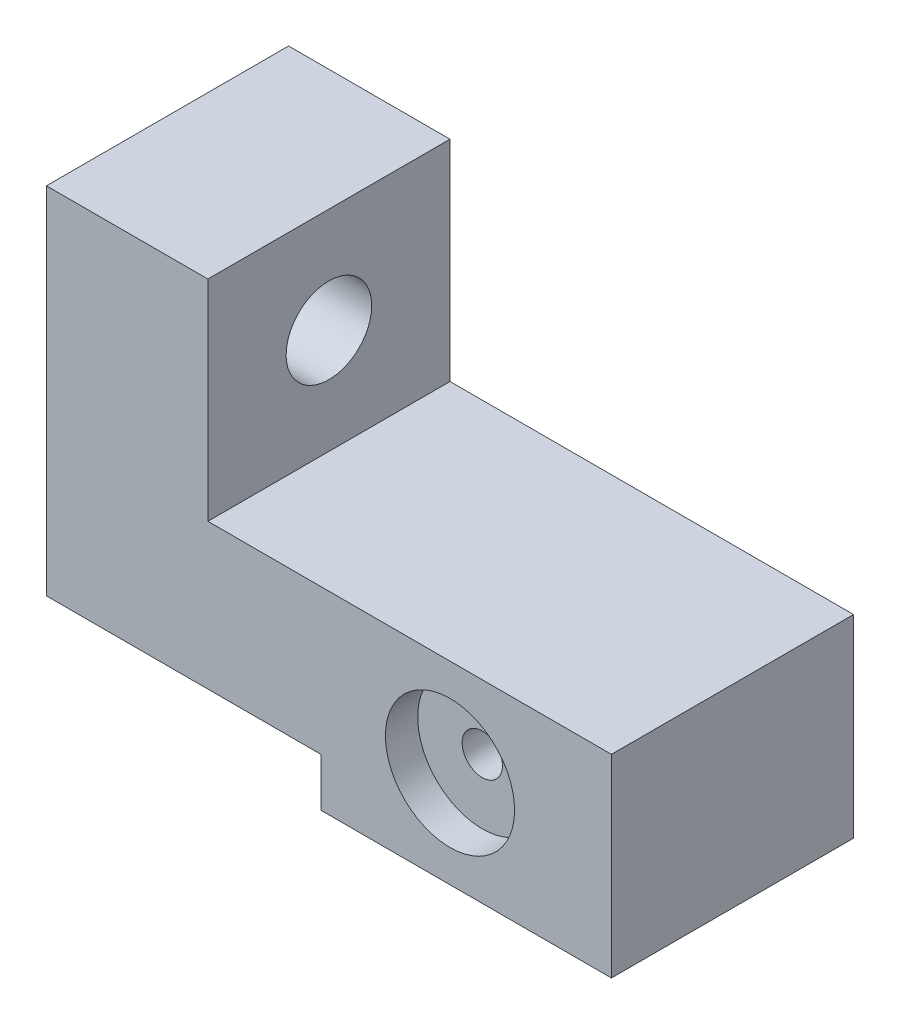
ISO-10303-21;
HEADER;
FILE_DESCRIPTION(('STEP AP214'),'2;1');
FILE_NAME('part.step','',(''),(''),'','','');
FILE_SCHEMA(('AUTOMOTIVE_DESIGN { 1 0 10303 214 1 1 1 1 }'));
ENDSEC;
DATA;
#1=APPLICATION_CONTEXT('core data for automotive mechanical design processes');
#2=APPLICATION_PROTOCOL_DEFINITION('international standard','automotive_design',2000,#1);
#3=PRODUCT_CONTEXT('',#1,'mechanical');
#4=PRODUCT('Part','Part','',(#3));
#5=PRODUCT_RELATED_PRODUCT_CATEGORY('part','',(#4));
#6=PRODUCT_DEFINITION_FORMATION('','',#4);
#7=PRODUCT_DEFINITION_CONTEXT('part definition',#1,'design');
#8=PRODUCT_DEFINITION('design','',#6,#7);
#9=PRODUCT_DEFINITION_SHAPE('','',#8);
#10=(LENGTH_UNIT() NAMED_UNIT(*) SI_UNIT(.MILLI.,.METRE.));
#11=(NAMED_UNIT(*) PLANE_ANGLE_UNIT() SI_UNIT($,.RADIAN.));
#12=(NAMED_UNIT(*) SI_UNIT($,.STERADIAN.) SOLID_ANGLE_UNIT());
#13=UNCERTAINTY_MEASURE_WITH_UNIT(LENGTH_MEASURE(1.E-05),#10,'distance_accuracy_value','');
#14=(GEOMETRIC_REPRESENTATION_CONTEXT(3) GLOBAL_UNCERTAINTY_ASSIGNED_CONTEXT((#13)) GLOBAL_UNIT_ASSIGNED_CONTEXT((#10,
#11,#12)) REPRESENTATION_CONTEXT('',''));
#15=CARTESIAN_POINT('',(0.,0.,0.));
#16=DIRECTION('',(0.,0.,1.));
#17=DIRECTION('',(1.,0.,0.));
#18=AXIS2_PLACEMENT_3D('',#15,#16,#17);
#19=CARTESIAN_POINT('',(25.,6.,15.));
#20=DIRECTION('',(0.,0.,1.));
#21=DIRECTION('',(1.,0.,0.));
#22=AXIS2_PLACEMENT_3D('',#19,#20,#21);
#23=CYLINDRICAL_SURFACE('',#22,1.24999999999999);
#24=CARTESIAN_POINT('',(25.,6.,0.));
#25=DIRECTION('',(0.,0.,1.));
#26=DIRECTION('',(1.,0.,0.));
#27=AXIS2_PLACEMENT_3D('',#24,#25,#26);
#28=CIRCLE('',#27,1.25);
#29=CARTESIAN_POINT('',(26.25,6.,0.));
#30=VERTEX_POINT('',#29);
#31=EDGE_CURVE('E181',#30,#30,#28,.T.);
#32=ORIENTED_EDGE('',*,*,#31,.F.);
#33=EDGE_LOOP('',(#32));
#34=FACE_BOUND('',#33,.T.);
#35=CARTESIAN_POINT('',(25.,6.,13.));
#36=DIRECTION('',(0.,0.,1.));
#37=DIRECTION('',(1.,0.,0.));
#38=AXIS2_PLACEMENT_3D('',#35,#36,#37);
#39=CIRCLE('',#38,1.24999999999999);
#40=CARTESIAN_POINT('',(26.25,6.,13.));
#41=VERTEX_POINT('',#40);
#42=EDGE_CURVE('E55',#41,#41,#39,.F.);
#43=ORIENTED_EDGE('',*,*,#42,.F.);
#44=EDGE_LOOP('',(#43));
#45=FACE_BOUND('',#44,.T.);
#46=ADVANCED_FACE('F51',(#34,#45),#23,.F.);
#47=CARTESIAN_POINT('',(35.,0.,15.));
#48=DIRECTION('',(-1.,0.,0.));
#49=DIRECTION('',(0.,0.,1.));
#50=AXIS2_PLACEMENT_3D('',#47,#48,#49);
#51=PLANE('',#50);
#52=DIRECTION('',(0.,1.,0.));
#53=VECTOR('',#52,1.);
#54=CARTESIAN_POINT('',(35.,0.,0.));
#55=LINE('',#54,#53);
#56=CARTESIAN_POINT('',(35.,0.,0.));
#57=VERTEX_POINT('',#56);
#58=CARTESIAN_POINT('',(35.,12.,0.));
#59=VERTEX_POINT('',#58);
#60=EDGE_CURVE('E150',#57,#59,#55,.T.);
#61=ORIENTED_EDGE('',*,*,#60,.T.);
#62=DIRECTION('',(0.,0.,-1.));
#63=VECTOR('',#62,1.);
#64=CARTESIAN_POINT('',(35.,12.,15.));
#65=LINE('',#64,#63);
#66=CARTESIAN_POINT('',(35.,12.,15.));
#67=VERTEX_POINT('',#66);
#68=EDGE_CURVE('E13',#67,#59,#65,.T.);
#69=ORIENTED_EDGE('',*,*,#68,.F.);
#70=DIRECTION('',(0.,1.,0.));
#71=VECTOR('',#70,1.);
#72=CARTESIAN_POINT('',(35.,0.,15.));
#73=LINE('',#72,#71);
#74=CARTESIAN_POINT('',(35.,0.,15.));
#75=VERTEX_POINT('',#74);
#76=EDGE_CURVE('E165',#75,#67,#73,.T.);
#77=ORIENTED_EDGE('',*,*,#76,.F.);
#78=DIRECTION('',(0.,0.,-1.));
#79=VECTOR('',#78,1.);
#80=CARTESIAN_POINT('',(35.,0.,15.));
#81=LINE('',#80,#79);
#82=EDGE_CURVE('E146',#75,#57,#81,.T.);
#83=ORIENTED_EDGE('',*,*,#82,.T.);
#84=EDGE_LOOP('',(#61,#69,#77,#83));
#85=FACE_BOUND('',#84,.T.);
#86=ADVANCED_FACE('F53',(#85),#51,.F.);
#87=CARTESIAN_POINT('',(35.,12.,15.));
#88=DIRECTION('',(0.,-1.,0.));
#89=DIRECTION('',(1.,0.,0.));
#90=AXIS2_PLACEMENT_3D('',#87,#88,#89);
#91=PLANE('',#90);
#92=DIRECTION('',(-1.,0.,0.));
#93=VECTOR('',#92,1.);
#94=CARTESIAN_POINT('',(35.,12.,0.));
#95=LINE('',#94,#93);
#96=CARTESIAN_POINT('',(10.,12.,0.));
#97=VERTEX_POINT('',#96);
#98=EDGE_CURVE('E153',#59,#97,#95,.T.);
#99=ORIENTED_EDGE('',*,*,#98,.T.);
#100=DIRECTION('',(0.,0.,-1.));
#101=VECTOR('',#100,1.);
#102=CARTESIAN_POINT('',(10.,12.,15.));
#103=LINE('',#102,#101);
#104=CARTESIAN_POINT('',(10.,12.,15.));
#105=VERTEX_POINT('',#104);
#106=EDGE_CURVE('E61',#105,#97,#103,.T.);
#107=ORIENTED_EDGE('',*,*,#106,.F.);
#108=DIRECTION('',(-1.,0.,0.));
#109=VECTOR('',#108,1.);
#110=CARTESIAN_POINT('',(35.,12.,15.));
#111=LINE('',#110,#109);
#112=EDGE_CURVE('E113',#67,#105,#111,.T.);
#113=ORIENTED_EDGE('',*,*,#112,.F.);
#114=ORIENTED_EDGE('',*,*,#68,.T.);
#115=EDGE_LOOP('',(#99,#107,#113,#114));
#116=FACE_BOUND('',#115,.T.);
#117=ADVANCED_FACE('F228',(#116),#91,.F.);
#118=CARTESIAN_POINT('',(10.,12.,15.));
#119=DIRECTION('',(-1.,0.,0.));
#120=DIRECTION('',(0.,-1.,0.));
#121=AXIS2_PLACEMENT_3D('',#118,#119,#120);
#122=PLANE('',#121);
#123=CARTESIAN_POINT('',(10.,18.5,7.5));
#124=DIRECTION('',(1.,0.,0.));
#125=DIRECTION('',(0.,1.,0.));
#126=AXIS2_PLACEMENT_3D('',#123,#124,#125);
#127=CIRCLE('',#126,2.65);
#128=CARTESIAN_POINT('',(10.,21.15,7.5));
#129=VERTEX_POINT('',#128);
#130=EDGE_CURVE('E177',#129,#129,#127,.T.);
#131=ORIENTED_EDGE('',*,*,#130,.F.);
#132=EDGE_LOOP('',(#131));
#133=FACE_BOUND('',#132,.T.);
#134=DIRECTION('',(0.,1.,0.));
#135=VECTOR('',#134,1.);
#136=CARTESIAN_POINT('',(10.,12.,0.));
#137=LINE('',#136,#135);
#138=CARTESIAN_POINT('',(10.,25.,0.));
#139=VERTEX_POINT('',#138);
#140=EDGE_CURVE('E156',#97,#139,#137,.T.);
#141=ORIENTED_EDGE('',*,*,#140,.T.);
#142=DIRECTION('',(0.,0.,-1.));
#143=VECTOR('',#142,1.);
#144=CARTESIAN_POINT('',(10.,25.,15.));
#145=LINE('',#144,#143);
#146=CARTESIAN_POINT('',(10.,25.,15.));
#147=VERTEX_POINT('',#146);
#148=EDGE_CURVE('E172',#147,#139,#145,.T.);
#149=ORIENTED_EDGE('',*,*,#148,.F.);
#150=DIRECTION('',(0.,1.,0.));
#151=VECTOR('',#150,1.);
#152=CARTESIAN_POINT('',(10.,12.,15.));
#153=LINE('',#152,#151);
#154=EDGE_CURVE('E191',#105,#147,#153,.T.);
#155=ORIENTED_EDGE('',*,*,#154,.F.);
#156=ORIENTED_EDGE('',*,*,#106,.T.);
#157=EDGE_LOOP('',(#141,#149,#155,#156));
#158=FACE_BOUND('',#157,.T.);
#159=ADVANCED_FACE('F309',(#133,#158),#122,.F.);
#160=CARTESIAN_POINT('',(10.,25.,15.));
#161=DIRECTION('',(0.,-1.,0.));
#162=DIRECTION('',(0.,0.,-1.));
#163=AXIS2_PLACEMENT_3D('',#160,#161,#162);
#164=PLANE('',#163);
#165=DIRECTION('',(-1.,0.,0.));
#166=VECTOR('',#165,1.);
#167=CARTESIAN_POINT('',(10.,25.,0.));
#168=LINE('',#167,#166);
#169=CARTESIAN_POINT('',(0.,25.,0.));
#170=VERTEX_POINT('',#169);
#171=EDGE_CURVE('E158',#139,#170,#168,.T.);
#172=ORIENTED_EDGE('',*,*,#171,.T.);
#173=DIRECTION('',(0.,0.,-1.));
#174=VECTOR('',#173,1.);
#175=CARTESIAN_POINT('',(0.,25.,15.));
#176=LINE('',#175,#174);
#177=CARTESIAN_POINT('',(0.,25.,15.));
#178=VERTEX_POINT('',#177);
#179=EDGE_CURVE('E169',#178,#170,#176,.T.);
#180=ORIENTED_EDGE('',*,*,#179,.F.);
#181=DIRECTION('',(-1.,0.,0.));
#182=VECTOR('',#181,1.);
#183=CARTESIAN_POINT('',(10.,25.,15.));
#184=LINE('',#183,#182);
#185=EDGE_CURVE('E193',#147,#178,#184,.T.);
#186=ORIENTED_EDGE('',*,*,#185,.F.);
#187=ORIENTED_EDGE('',*,*,#148,.T.);
#188=EDGE_LOOP('',(#172,#180,#186,#187));
#189=FACE_BOUND('',#188,.T.);
#190=ADVANCED_FACE('F199',(#189),#164,.F.);
#191=CARTESIAN_POINT('',(0.,25.,15.));
#192=DIRECTION('',(1.,0.,0.));
#193=DIRECTION('',(0.,1.,0.));
#194=AXIS2_PLACEMENT_3D('',#191,#192,#193);
#195=PLANE('',#194);
#196=CARTESIAN_POINT('',(0.,18.5,7.5));
#197=DIRECTION('',(1.,0.,0.));
#198=DIRECTION('',(0.,1.,0.));
#199=AXIS2_PLACEMENT_3D('',#196,#197,#198);
#200=CIRCLE('',#199,2.65);
#201=CARTESIAN_POINT('',(0.,21.15,7.5));
#202=VERTEX_POINT('',#201);
#203=EDGE_CURVE('E154',#202,#202,#200,.T.);
#204=ORIENTED_EDGE('',*,*,#203,.T.);
#205=EDGE_LOOP('',(#204));
#206=FACE_BOUND('',#205,.T.);
#207=DIRECTION('',(0.,-1.,0.));
#208=VECTOR('',#207,1.);
#209=CARTESIAN_POINT('',(0.,25.,0.));
#210=LINE('',#209,#208);
#211=CARTESIAN_POINT('',(0.,2.99999999999999,0.));
#212=VERTEX_POINT('',#211);
#213=EDGE_CURVE('E160',#170,#212,#210,.T.);
#214=ORIENTED_EDGE('',*,*,#213,.T.);
#215=DIRECTION('',(0.,0.,-1.));
#216=VECTOR('',#215,1.);
#217=CARTESIAN_POINT('',(0.,2.99999999999999,15.));
#218=LINE('',#217,#216);
#219=CARTESIAN_POINT('',(0.,2.99999999999999,15.));
#220=VERTEX_POINT('',#219);
#221=EDGE_CURVE('E141',#220,#212,#218,.T.);
#222=ORIENTED_EDGE('',*,*,#221,.F.);
#223=DIRECTION('',(0.,-1.,0.));
#224=VECTOR('',#223,1.);
#225=CARTESIAN_POINT('',(0.,25.,15.));
#226=LINE('',#225,#224);
#227=EDGE_CURVE('E132',#178,#220,#226,.T.);
#228=ORIENTED_EDGE('',*,*,#227,.F.);
#229=ORIENTED_EDGE('',*,*,#179,.T.);
#230=EDGE_LOOP('',(#214,#222,#228,#229));
#231=FACE_BOUND('',#230,.T.);
#232=ADVANCED_FACE('F203',(#206,#231),#195,.F.);
#233=CARTESIAN_POINT('',(17.,3.,15.));
#234=DIRECTION('',(0.,1.,0.));
#235=DIRECTION('',(-1.,0.,0.));
#236=AXIS2_PLACEMENT_3D('',#233,#234,#235);
#237=PLANE('',#236);
#238=DIRECTION('',(1.,0.,0.));
#239=VECTOR('',#238,1.);
#240=CARTESIAN_POINT('',(17.,3.,0.));
#241=LINE('',#240,#239);
#242=CARTESIAN_POINT('',(17.,3.,0.));
#243=VERTEX_POINT('',#242);
#244=EDGE_CURVE('E140',#212,#243,#241,.T.);
#245=ORIENTED_EDGE('',*,*,#244,.T.);
#246=DIRECTION('',(0.,0.,-1.));
#247=VECTOR('',#246,1.);
#248=CARTESIAN_POINT('',(17.,3.,15.));
#249=LINE('',#248,#247);
#250=CARTESIAN_POINT('',(17.,3.,15.));
#251=VERTEX_POINT('',#250);
#252=EDGE_CURVE('E137',#251,#243,#249,.T.);
#253=ORIENTED_EDGE('',*,*,#252,.F.);
#254=DIRECTION('',(1.,0.,0.));
#255=VECTOR('',#254,1.);
#256=CARTESIAN_POINT('',(17.,3.,15.));
#257=LINE('',#256,#255);
#258=EDGE_CURVE('E126',#220,#251,#257,.T.);
#259=ORIENTED_EDGE('',*,*,#258,.F.);
#260=ORIENTED_EDGE('',*,*,#221,.T.);
#261=EDGE_LOOP('',(#245,#253,#259,#260));
#262=FACE_BOUND('',#261,.T.);
#263=ADVANCED_FACE('F138',(#262),#237,.F.);
#264=CARTESIAN_POINT('',(17.,0.,15.));
#265=DIRECTION('',(1.,0.,0.));
#266=DIRECTION('',(0.,0.,-1.));
#267=AXIS2_PLACEMENT_3D('',#264,#265,#266);
#268=PLANE('',#267);
#269=DIRECTION('',(0.,-1.,0.));
#270=VECTOR('',#269,1.);
#271=CARTESIAN_POINT('',(17.,0.,0.));
#272=LINE('',#271,#270);
#273=CARTESIAN_POINT('',(17.,0.,0.));
#274=VERTEX_POINT('',#273);
#275=EDGE_CURVE('E99',#243,#274,#272,.T.);
#276=ORIENTED_EDGE('',*,*,#275,.T.);
#277=DIRECTION('',(0.,0.,-1.));
#278=VECTOR('',#277,1.);
#279=CARTESIAN_POINT('',(17.,0.,15.));
#280=LINE('',#279,#278);
#281=CARTESIAN_POINT('',(17.,0.,15.));
#282=VERTEX_POINT('',#281);
#283=EDGE_CURVE('E142',#282,#274,#280,.T.);
#284=ORIENTED_EDGE('',*,*,#283,.F.);
#285=DIRECTION('',(0.,-1.,0.));
#286=VECTOR('',#285,1.);
#287=CARTESIAN_POINT('',(17.,0.,15.));
#288=LINE('',#287,#286);
#289=EDGE_CURVE('E130',#251,#282,#288,.T.);
#290=ORIENTED_EDGE('',*,*,#289,.F.);
#291=ORIENTED_EDGE('',*,*,#252,.T.);
#292=EDGE_LOOP('',(#276,#284,#290,#291));
#293=FACE_BOUND('',#292,.T.);
#294=ADVANCED_FACE('F144',(#293),#268,.F.);
#295=CARTESIAN_POINT('',(35.,0.,15.));
#296=DIRECTION('',(0.,1.,0.));
#297=DIRECTION('',(-1.,0.,0.));
#298=AXIS2_PLACEMENT_3D('',#295,#296,#297);
#299=PLANE('',#298);
#300=DIRECTION('',(1.,0.,0.));
#301=VECTOR('',#300,1.);
#302=CARTESIAN_POINT('',(35.,0.,0.));
#303=LINE('',#302,#301);
#304=EDGE_CURVE('E105',#274,#57,#303,.T.);
#305=ORIENTED_EDGE('',*,*,#304,.T.);
#306=ORIENTED_EDGE('',*,*,#82,.F.);
#307=DIRECTION('',(1.,0.,0.));
#308=VECTOR('',#307,1.);
#309=CARTESIAN_POINT('',(35.,0.,15.));
#310=LINE('',#309,#308);
#311=EDGE_CURVE('E70',#282,#75,#310,.T.);
#312=ORIENTED_EDGE('',*,*,#311,.F.);
#313=ORIENTED_EDGE('',*,*,#283,.T.);
#314=EDGE_LOOP('',(#305,#306,#312,#313));
#315=FACE_BOUND('',#314,.T.);
#316=ADVANCED_FACE('F211',(#315),#299,.F.);
#317=CARTESIAN_POINT('',(0.,0.,15.));
#318=DIRECTION('',(0.,0.,1.));
#319=DIRECTION('',(1.,0.,0.));
#320=AXIS2_PLACEMENT_3D('',#317,#318,#319);
#321=PLANE('',#320);
#322=CARTESIAN_POINT('',(25.,6.,15.));
#323=DIRECTION('',(0.,0.,1.));
#324=DIRECTION('',(1.,0.,0.));
#325=AXIS2_PLACEMENT_3D('',#322,#323,#324);
#326=CIRCLE('',#325,4.);
#327=CARTESIAN_POINT('',(29.,6.,15.));
#328=VERTEX_POINT('',#327);
#329=EDGE_CURVE('E344',#328,#328,#326,.T.);
#330=ORIENTED_EDGE('',*,*,#329,.F.);
#331=EDGE_LOOP('',(#330));
#332=FACE_BOUND('',#331,.T.);
#333=ORIENTED_EDGE('',*,*,#76,.T.);
#334=ORIENTED_EDGE('',*,*,#112,.T.);
#335=ORIENTED_EDGE('',*,*,#154,.T.);
#336=ORIENTED_EDGE('',*,*,#185,.T.);
#337=ORIENTED_EDGE('',*,*,#227,.T.);
#338=ORIENTED_EDGE('',*,*,#258,.T.);
#339=ORIENTED_EDGE('',*,*,#289,.T.);
#340=ORIENTED_EDGE('',*,*,#311,.T.);
#341=EDGE_LOOP('',(#333,#334,#335,#336,#337,#338,#339,#340));
#342=FACE_BOUND('',#341,.T.);
#343=ADVANCED_FACE('F128',(#332,#342),#321,.T.);
#344=CARTESIAN_POINT('',(0.,0.,0.));
#345=DIRECTION('',(0.,0.,1.));
#346=DIRECTION('',(1.,0.,0.));
#347=AXIS2_PLACEMENT_3D('',#344,#345,#346);
#348=PLANE('',#347);
#349=ORIENTED_EDGE('',*,*,#31,.T.);
#350=EDGE_LOOP('',(#349));
#351=FACE_BOUND('',#350,.T.);
#352=ORIENTED_EDGE('',*,*,#60,.F.);
#353=ORIENTED_EDGE('',*,*,#304,.F.);
#354=ORIENTED_EDGE('',*,*,#275,.F.);
#355=ORIENTED_EDGE('',*,*,#244,.F.);
#356=ORIENTED_EDGE('',*,*,#213,.F.);
#357=ORIENTED_EDGE('',*,*,#171,.F.);
#358=ORIENTED_EDGE('',*,*,#140,.F.);
#359=ORIENTED_EDGE('',*,*,#98,.F.);
#360=EDGE_LOOP('',(#352,#353,#354,#355,#356,#357,#358,#359));
#361=FACE_BOUND('',#360,.T.);
#362=ADVANCED_FACE('F206',(#351,#361),#348,.F.);
#363=CARTESIAN_POINT('',(-4.99999999999999,18.5,7.5));
#364=DIRECTION('',(1.,0.,0.));
#365=DIRECTION('',(0.,1.,0.));
#366=AXIS2_PLACEMENT_3D('',#363,#364,#365);
#367=CYLINDRICAL_SURFACE('',#366,2.65);
#368=ORIENTED_EDGE('',*,*,#130,.T.);
#369=EDGE_LOOP('',(#368));
#370=FACE_BOUND('',#369,.T.);
#371=ORIENTED_EDGE('',*,*,#203,.F.);
#372=EDGE_LOOP('',(#371));
#373=FACE_BOUND('',#372,.T.);
#374=ADVANCED_FACE('F235',(#370,#373),#367,.F.);
#375=CARTESIAN_POINT('',(25.,6.,13.));
#376=DIRECTION('',(0.,0.,1.));
#377=DIRECTION('',(1.,0.,0.));
#378=AXIS2_PLACEMENT_3D('',#375,#376,#377);
#379=PLANE('',#378);
#380=CARTESIAN_POINT('',(25.,6.,13.));
#381=DIRECTION('',(0.,0.,1.));
#382=DIRECTION('',(1.,0.,0.));
#383=AXIS2_PLACEMENT_3D('',#380,#381,#382);
#384=CIRCLE('',#383,4.);
#385=CARTESIAN_POINT('',(29.,6.,13.));
#386=VERTEX_POINT('',#385);
#387=EDGE_CURVE('E341',#386,#386,#384,.T.);
#388=ORIENTED_EDGE('',*,*,#387,.T.);
#389=EDGE_LOOP('',(#388));
#390=FACE_BOUND('',#389,.T.);
#391=ORIENTED_EDGE('',*,*,#42,.T.);
#392=EDGE_LOOP('',(#391));
#393=FACE_BOUND('',#392,.T.);
#394=ADVANCED_FACE('F237',(#390,#393),#379,.T.);
#395=CARTESIAN_POINT('',(25.,6.,13.));
#396=DIRECTION('',(0.,0.,1.));
#397=DIRECTION('',(1.,0.,0.));
#398=AXIS2_PLACEMENT_3D('',#395,#396,#397);
#399=CYLINDRICAL_SURFACE('',#398,4.);
#400=ORIENTED_EDGE('',*,*,#387,.F.);
#401=EDGE_LOOP('',(#400));
#402=FACE_BOUND('',#401,.T.);
#403=ORIENTED_EDGE('',*,*,#329,.T.);
#404=EDGE_LOOP('',(#403));
#405=FACE_BOUND('',#404,.T.);
#406=ADVANCED_FACE('F233',(#402,#405),#399,.F.);
#407=CLOSED_SHELL('',(#46,#86,#117,#159,#190,#232,#263,#294,#316,#343,#362,#374,#394,#406));
#408=MANIFOLD_SOLID_BREP('B2',#407);
#409=ADVANCED_BREP_SHAPE_REPRESENTATION('',(#18,#408),#14);
#410=SHAPE_DEFINITION_REPRESENTATION(#9,#409);
ENDSEC;
END-ISO-10303-21;
